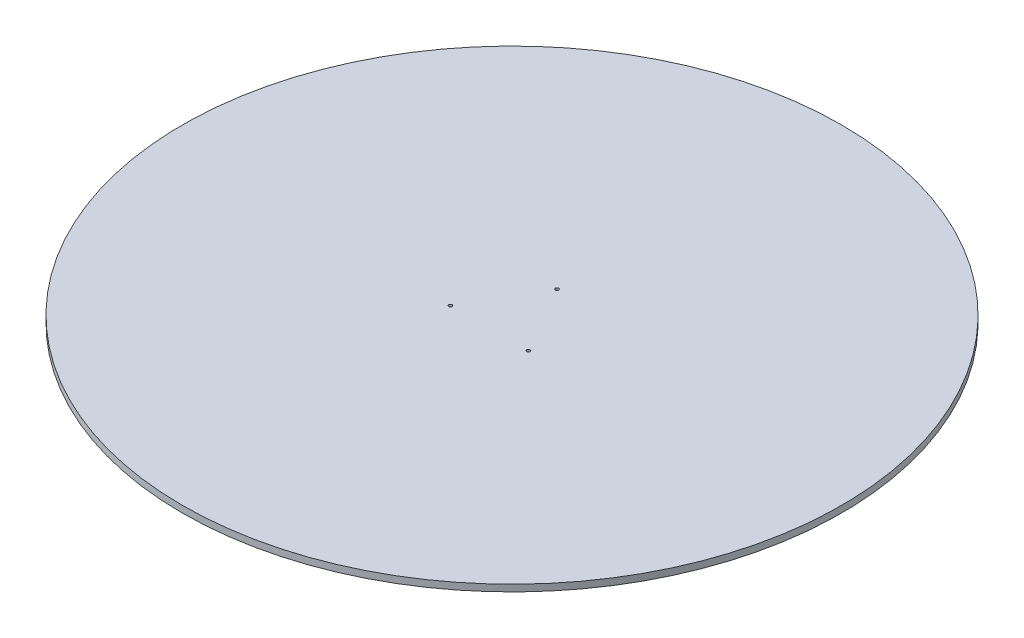
ISO-10303-21;
HEADER;
FILE_DESCRIPTION(('STEP AP214'),'2;1');
FILE_NAME('part.step','',(''),(''),'','','');
FILE_SCHEMA(('AUTOMOTIVE_DESIGN { 1 0 10303 214 1 1 1 1 }'));
ENDSEC;
DATA;
#1=APPLICATION_CONTEXT('core data for automotive mechanical design processes');
#2=APPLICATION_PROTOCOL_DEFINITION('international standard','automotive_design',2000,#1);
#3=PRODUCT_CONTEXT('',#1,'mechanical');
#4=PRODUCT('Part','Part','',(#3));
#5=PRODUCT_RELATED_PRODUCT_CATEGORY('part','',(#4));
#6=PRODUCT_DEFINITION_FORMATION('','',#4);
#7=PRODUCT_DEFINITION_CONTEXT('part definition',#1,'design');
#8=PRODUCT_DEFINITION('design','',#6,#7);
#9=PRODUCT_DEFINITION_SHAPE('','',#8);
#10=(LENGTH_UNIT() NAMED_UNIT(*) SI_UNIT(.MILLI.,.METRE.));
#11=(NAMED_UNIT(*) PLANE_ANGLE_UNIT() SI_UNIT($,.RADIAN.));
#12=(NAMED_UNIT(*) SI_UNIT($,.STERADIAN.) SOLID_ANGLE_UNIT());
#13=UNCERTAINTY_MEASURE_WITH_UNIT(LENGTH_MEASURE(1.E-05),#10,'distance_accuracy_value','');
#14=(GEOMETRIC_REPRESENTATION_CONTEXT(3) GLOBAL_UNCERTAINTY_ASSIGNED_CONTEXT((#13)) GLOBAL_UNIT_ASSIGNED_CONTEXT((#10,
#11,#12)) REPRESENTATION_CONTEXT('',''));
#15=CARTESIAN_POINT('',(0.,0.,0.));
#16=DIRECTION('',(0.,0.,1.));
#17=DIRECTION('',(1.,0.,0.));
#18=AXIS2_PLACEMENT_3D('',#15,#16,#17);
#19=CARTESIAN_POINT('',(1.18225977785981E-11,25.4,-170.883646842913));
#20=DIRECTION('',(0.,-1.,0.));
#21=DIRECTION('',(0.,0.,-1.));
#22=AXIS2_PLACEMENT_3D('',#19,#20,#21);
#23=CYLINDRICAL_SURFACE('',#22,6.35);
#24=CARTESIAN_POINT('',(1.18225977785981E-11,25.4,-170.883646842913));
#25=DIRECTION('',(0.,1.,0.));
#26=DIRECTION('',(0.,0.,1.));
#27=AXIS2_PLACEMENT_3D('',#24,#25,#26);
#28=CIRCLE('',#27,6.35);
#29=CARTESIAN_POINT('',(1.18225977785981E-11,25.4,-164.533646842913));
#30=VERTEX_POINT('',#29);
#31=EDGE_CURVE('E43',#30,#30,#28,.T.);
#32=ORIENTED_EDGE('',*,*,#31,.T.);
#33=EDGE_LOOP('',(#32));
#34=FACE_BOUND('',#33,.T.);
#35=CARTESIAN_POINT('',(1.18225977785981E-11,0.,-170.883646842913));
#36=DIRECTION('',(0.,1.,0.));
#37=DIRECTION('',(0.,0.,1.));
#38=AXIS2_PLACEMENT_3D('',#35,#36,#37);
#39=CIRCLE('',#38,6.35);
#40=CARTESIAN_POINT('',(1.18225977785981E-11,0.,-164.533646842913));
#41=VERTEX_POINT('',#40);
#42=EDGE_CURVE('E57',#41,#41,#39,.T.);
#43=ORIENTED_EDGE('',*,*,#42,.F.);
#44=EDGE_LOOP('',(#43));
#45=FACE_BOUND('',#44,.T.);
#46=ADVANCED_FACE('F35',(#34,#45),#23,.F.);
#47=CARTESIAN_POINT('',(147.989579257297,25.4,85.4418234214605));
#48=DIRECTION('',(0.,-1.,0.));
#49=DIRECTION('',(0.,0.,-1.));
#50=AXIS2_PLACEMENT_3D('',#47,#48,#49);
#51=CYLINDRICAL_SURFACE('',#50,6.34999999999999);
#52=CARTESIAN_POINT('',(147.989579257297,25.4,85.4418234214605));
#53=DIRECTION('',(0.,1.,0.));
#54=DIRECTION('',(0.,0.,1.));
#55=AXIS2_PLACEMENT_3D('',#52,#53,#54);
#56=CIRCLE('',#55,6.34999999999999);
#57=CARTESIAN_POINT('',(147.989579257297,25.4,91.7918234214605));
#58=VERTEX_POINT('',#57);
#59=EDGE_CURVE('E48',#58,#58,#56,.T.);
#60=ORIENTED_EDGE('',*,*,#59,.T.);
#61=EDGE_LOOP('',(#60));
#62=FACE_BOUND('',#61,.T.);
#63=CARTESIAN_POINT('',(147.989579257297,0.,85.4418234214605));
#64=DIRECTION('',(0.,1.,0.));
#65=DIRECTION('',(0.,0.,1.));
#66=AXIS2_PLACEMENT_3D('',#63,#64,#65);
#67=CIRCLE('',#66,6.34999999999999);
#68=CARTESIAN_POINT('',(147.989579257297,0.,91.7918234214605));
#69=VERTEX_POINT('',#68);
#70=EDGE_CURVE('E55',#69,#69,#67,.T.);
#71=ORIENTED_EDGE('',*,*,#70,.F.);
#72=EDGE_LOOP('',(#71));
#73=FACE_BOUND('',#72,.T.);
#74=ADVANCED_FACE('F72',(#62,#73),#51,.F.);
#75=CARTESIAN_POINT('',(-147.989579257287,25.4,85.4418234214528));
#76=DIRECTION('',(0.,-1.,0.));
#77=DIRECTION('',(0.,0.,-1.));
#78=AXIS2_PLACEMENT_3D('',#75,#76,#77);
#79=CYLINDRICAL_SURFACE('',#78,6.34999999999999);
#80=CARTESIAN_POINT('',(-147.989579257287,25.4,85.4418234214528));
#81=DIRECTION('',(0.,1.,0.));
#82=DIRECTION('',(0.,0.,1.));
#83=AXIS2_PLACEMENT_3D('',#80,#81,#82);
#84=CIRCLE('',#83,6.34999999999999);
#85=CARTESIAN_POINT('',(-147.989579257287,25.4,91.7918234214528));
#86=VERTEX_POINT('',#85);
#87=EDGE_CURVE('E62',#86,#86,#84,.T.);
#88=ORIENTED_EDGE('',*,*,#87,.T.);
#89=EDGE_LOOP('',(#88));
#90=FACE_BOUND('',#89,.T.);
#91=CARTESIAN_POINT('',(-147.989579257287,0.,85.4418234214528));
#92=DIRECTION('',(0.,1.,0.));
#93=DIRECTION('',(0.,0.,1.));
#94=AXIS2_PLACEMENT_3D('',#91,#92,#93);
#95=CIRCLE('',#94,6.34999999999999);
#96=CARTESIAN_POINT('',(-147.989579257287,0.,91.7918234214528));
#97=VERTEX_POINT('',#96);
#98=EDGE_CURVE('E52',#97,#97,#95,.T.);
#99=ORIENTED_EDGE('',*,*,#98,.F.);
#100=EDGE_LOOP('',(#99));
#101=FACE_BOUND('',#100,.T.);
#102=ADVANCED_FACE('F37',(#90,#101),#79,.F.);
#103=CARTESIAN_POINT('',(0.,25.4,0.));
#104=DIRECTION('',(0.,-1.,0.));
#105=DIRECTION('',(0.,0.,-1.));
#106=AXIS2_PLACEMENT_3D('',#103,#104,#105);
#107=CYLINDRICAL_SURFACE('',#106,1250.);
#108=CARTESIAN_POINT('',(0.,25.4,0.));
#109=DIRECTION('',(0.,1.,0.));
#110=DIRECTION('',(0.,0.,1.));
#111=AXIS2_PLACEMENT_3D('',#108,#109,#110);
#112=CIRCLE('',#111,1250.);
#113=CARTESIAN_POINT('',(0.,25.4,1250.));
#114=VERTEX_POINT('',#113);
#115=EDGE_CURVE('E10',#114,#114,#112,.T.);
#116=ORIENTED_EDGE('',*,*,#115,.F.);
#117=EDGE_LOOP('',(#116));
#118=FACE_BOUND('',#117,.T.);
#119=CARTESIAN_POINT('',(0.,0.,0.));
#120=DIRECTION('',(0.,1.,0.));
#121=DIRECTION('',(0.,0.,1.));
#122=AXIS2_PLACEMENT_3D('',#119,#120,#121);
#123=CIRCLE('',#122,1250.);
#124=CARTESIAN_POINT('',(0.,0.,1250.));
#125=VERTEX_POINT('',#124);
#126=EDGE_CURVE('E39',#125,#125,#123,.T.);
#127=ORIENTED_EDGE('',*,*,#126,.T.);
#128=EDGE_LOOP('',(#127));
#129=FACE_BOUND('',#128,.T.);
#130=ADVANCED_FACE('F79',(#118,#129),#107,.T.);
#131=CARTESIAN_POINT('',(0.,25.4,0.));
#132=DIRECTION('',(0.,1.,0.));
#133=DIRECTION('',(0.,0.,1.));
#134=AXIS2_PLACEMENT_3D('',#131,#132,#133);
#135=PLANE('',#134);
#136=ORIENTED_EDGE('',*,*,#87,.F.);
#137=EDGE_LOOP('',(#136));
#138=FACE_BOUND('',#137,.T.);
#139=ORIENTED_EDGE('',*,*,#59,.F.);
#140=EDGE_LOOP('',(#139));
#141=FACE_BOUND('',#140,.T.);
#142=ORIENTED_EDGE('',*,*,#31,.F.);
#143=EDGE_LOOP('',(#142));
#144=FACE_BOUND('',#143,.T.);
#145=ORIENTED_EDGE('',*,*,#115,.T.);
#146=EDGE_LOOP('',(#145));
#147=FACE_BOUND('',#146,.T.);
#148=ADVANCED_FACE('F75',(#138,#141,#144,#147),#135,.T.);
#149=CARTESIAN_POINT('',(0.,0.,0.));
#150=DIRECTION('',(0.,1.,0.));
#151=DIRECTION('',(0.,0.,1.));
#152=AXIS2_PLACEMENT_3D('',#149,#150,#151);
#153=PLANE('',#152);
#154=ORIENTED_EDGE('',*,*,#98,.T.);
#155=EDGE_LOOP('',(#154));
#156=FACE_BOUND('',#155,.T.);
#157=ORIENTED_EDGE('',*,*,#70,.T.);
#158=EDGE_LOOP('',(#157));
#159=FACE_BOUND('',#158,.T.);
#160=ORIENTED_EDGE('',*,*,#42,.T.);
#161=EDGE_LOOP('',(#160));
#162=FACE_BOUND('',#161,.T.);
#163=ORIENTED_EDGE('',*,*,#126,.F.);
#164=EDGE_LOOP('',(#163));
#165=FACE_BOUND('',#164,.T.);
#166=ADVANCED_FACE('F78',(#156,#159,#162,#165),#153,.F.);
#167=CLOSED_SHELL('',(#46,#74,#102,#130,#148,#166));
#168=MANIFOLD_SOLID_BREP('B2',#167);
#169=ADVANCED_BREP_SHAPE_REPRESENTATION('',(#18,#168),#14);
#170=SHAPE_DEFINITION_REPRESENTATION(#9,#169);
ENDSEC;
END-ISO-10303-21;
